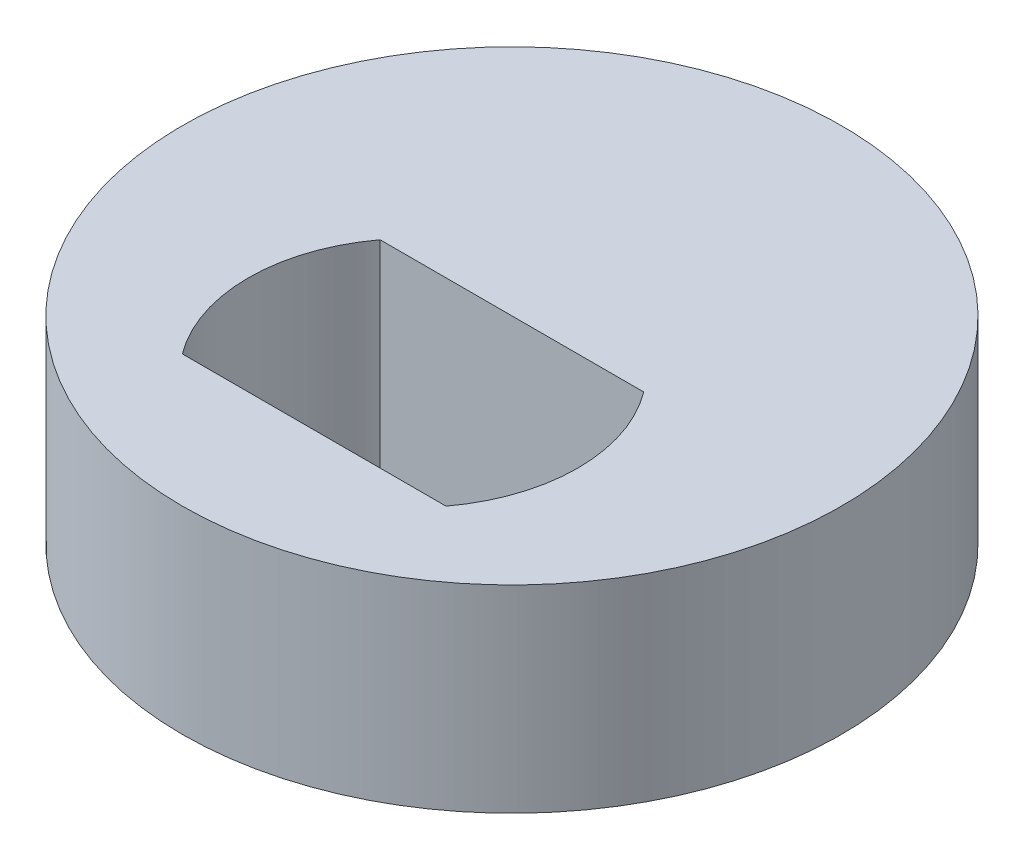
ISO-10303-21;
HEADER;
FILE_DESCRIPTION(('STEP AP214'),'2;1');
FILE_NAME('part.step','',(''),(''),'','','');
FILE_SCHEMA(('AUTOMOTIVE_DESIGN { 1 0 10303 214 1 1 1 1 }'));
ENDSEC;
DATA;
#1=APPLICATION_CONTEXT('core data for automotive mechanical design processes');
#2=APPLICATION_PROTOCOL_DEFINITION('international standard','automotive_design',2000,#1);
#3=PRODUCT_CONTEXT('',#1,'mechanical');
#4=PRODUCT('Part','Part','',(#3));
#5=PRODUCT_RELATED_PRODUCT_CATEGORY('part','',(#4));
#6=PRODUCT_DEFINITION_FORMATION('','',#4);
#7=PRODUCT_DEFINITION_CONTEXT('part definition',#1,'design');
#8=PRODUCT_DEFINITION('design','',#6,#7);
#9=PRODUCT_DEFINITION_SHAPE('','',#8);
#10=(LENGTH_UNIT() NAMED_UNIT(*) SI_UNIT(.MILLI.,.METRE.));
#11=(NAMED_UNIT(*) PLANE_ANGLE_UNIT() SI_UNIT($,.RADIAN.));
#12=(NAMED_UNIT(*) SI_UNIT($,.STERADIAN.) SOLID_ANGLE_UNIT());
#13=UNCERTAINTY_MEASURE_WITH_UNIT(LENGTH_MEASURE(1.E-05),#10,'distance_accuracy_value','');
#14=(GEOMETRIC_REPRESENTATION_CONTEXT(3) GLOBAL_UNCERTAINTY_ASSIGNED_CONTEXT((#13)) GLOBAL_UNIT_ASSIGNED_CONTEXT((#10,
#11,#12)) REPRESENTATION_CONTEXT('',''));
#15=CARTESIAN_POINT('',(0.,0.,0.));
#16=DIRECTION('',(0.,0.,1.));
#17=DIRECTION('',(1.,0.,0.));
#18=AXIS2_PLACEMENT_3D('',#15,#16,#17);
#19=CARTESIAN_POINT('',(0.,3.,0.));
#20=DIRECTION('',(0.,1.,0.));
#21=DIRECTION('',(0.,0.,1.));
#22=AXIS2_PLACEMENT_3D('',#19,#20,#21);
#23=PLANE('',#22);
#24=CARTESIAN_POINT('',(0.,3.,0.));
#25=DIRECTION('',(0.,1.,0.));
#26=DIRECTION('',(0.,0.,1.));
#27=AXIS2_PLACEMENT_3D('',#24,#25,#26);
#28=CIRCLE('',#27,5.);
#29=CARTESIAN_POINT('',(0.,3.,5.));
#30=VERTEX_POINT('',#29);
#31=EDGE_CURVE('E11',#30,#30,#28,.T.);
#32=ORIENTED_EDGE('',*,*,#31,.T.);
#33=EDGE_LOOP('',(#32));
#34=FACE_BOUND('',#33,.T.);
#35=DIRECTION('',(1.,0.,0.));
#36=VECTOR('',#35,1.);
#37=CARTESIAN_POINT('',(-2.,3.,3.));
#38=LINE('',#37,#36);
#39=CARTESIAN_POINT('',(-2.,3.,3.));
#40=VERTEX_POINT('',#39);
#41=CARTESIAN_POINT('',(2.,3.,3.));
#42=VERTEX_POINT('',#41);
#43=EDGE_CURVE('E95',#40,#42,#38,.T.);
#44=ORIENTED_EDGE('',*,*,#43,.F.);
#45=CARTESIAN_POINT('',(0.,3.,1.5));
#46=DIRECTION('',(0.,1.,0.));
#47=DIRECTION('',(0.,0.,1.));
#48=AXIS2_PLACEMENT_3D('',#45,#46,#47);
#49=CIRCLE('',#48,2.5);
#50=CARTESIAN_POINT('',(-2.,3.,0.));
#51=VERTEX_POINT('',#50);
#52=EDGE_CURVE('E86',#51,#40,#49,.T.);
#53=ORIENTED_EDGE('',*,*,#52,.F.);
#54=DIRECTION('',(-1.,0.,0.));
#55=VECTOR('',#54,1.);
#56=CARTESIAN_POINT('',(-2.,3.,0.));
#57=LINE('',#56,#55);
#58=CARTESIAN_POINT('',(2.,3.,0.));
#59=VERTEX_POINT('',#58);
#60=EDGE_CURVE('E111',#59,#51,#57,.T.);
#61=ORIENTED_EDGE('',*,*,#60,.F.);
#62=CARTESIAN_POINT('',(0.,3.,1.5));
#63=DIRECTION('',(0.,1.,0.));
#64=DIRECTION('',(0.,0.,1.));
#65=AXIS2_PLACEMENT_3D('',#62,#63,#64);
#66=CIRCLE('',#65,2.5);
#67=EDGE_CURVE('E107',#42,#59,#66,.T.);
#68=ORIENTED_EDGE('',*,*,#67,.F.);
#69=EDGE_LOOP('',(#44,#53,#61,#68));
#70=FACE_BOUND('',#69,.T.);
#71=ADVANCED_FACE('F44',(#34,#70),#23,.T.);
#72=CARTESIAN_POINT('',(0.,0.,0.));
#73=DIRECTION('',(0.,1.,0.));
#74=DIRECTION('',(0.,0.,1.));
#75=AXIS2_PLACEMENT_3D('',#72,#73,#74);
#76=PLANE('',#75);
#77=CARTESIAN_POINT('',(0.,0.,0.));
#78=DIRECTION('',(0.,1.,0.));
#79=DIRECTION('',(0.,0.,1.));
#80=AXIS2_PLACEMENT_3D('',#77,#78,#79);
#81=CIRCLE('',#80,5.);
#82=CARTESIAN_POINT('',(0.,0.,5.));
#83=VERTEX_POINT('',#82);
#84=EDGE_CURVE('E48',#83,#83,#81,.T.);
#85=ORIENTED_EDGE('',*,*,#84,.F.);
#86=EDGE_LOOP('',(#85));
#87=FACE_BOUND('',#86,.T.);
#88=CARTESIAN_POINT('',(0.,0.,1.5));
#89=DIRECTION('',(0.,1.,0.));
#90=DIRECTION('',(0.,0.,1.));
#91=AXIS2_PLACEMENT_3D('',#88,#89,#90);
#92=CIRCLE('',#91,2.5);
#93=CARTESIAN_POINT('',(-2.,0.,0.));
#94=VERTEX_POINT('',#93);
#95=CARTESIAN_POINT('',(-2.,0.,3.));
#96=VERTEX_POINT('',#95);
#97=EDGE_CURVE('E68',#94,#96,#92,.T.);
#98=ORIENTED_EDGE('',*,*,#97,.T.);
#99=DIRECTION('',(1.,0.,0.));
#100=VECTOR('',#99,1.);
#101=CARTESIAN_POINT('',(-2.,0.,3.));
#102=LINE('',#101,#100);
#103=CARTESIAN_POINT('',(2.,0.,3.));
#104=VERTEX_POINT('',#103);
#105=EDGE_CURVE('E102',#96,#104,#102,.T.);
#106=ORIENTED_EDGE('',*,*,#105,.T.);
#107=CARTESIAN_POINT('',(0.,0.,1.5));
#108=DIRECTION('',(0.,1.,0.));
#109=DIRECTION('',(0.,0.,1.));
#110=AXIS2_PLACEMENT_3D('',#107,#108,#109);
#111=CIRCLE('',#110,2.5);
#112=CARTESIAN_POINT('',(2.,0.,0.));
#113=VERTEX_POINT('',#112);
#114=EDGE_CURVE('E120',#104,#113,#111,.T.);
#115=ORIENTED_EDGE('',*,*,#114,.T.);
#116=DIRECTION('',(-1.,0.,0.));
#117=VECTOR('',#116,1.);
#118=CARTESIAN_POINT('',(-2.,0.,0.));
#119=LINE('',#118,#117);
#120=EDGE_CURVE('E96',#113,#94,#119,.T.);
#121=ORIENTED_EDGE('',*,*,#120,.T.);
#122=EDGE_LOOP('',(#98,#106,#115,#121));
#123=FACE_BOUND('',#122,.T.);
#124=ADVANCED_FACE('F136',(#87,#123),#76,.F.);
#125=CARTESIAN_POINT('',(0.,3.,0.));
#126=DIRECTION('',(0.,-1.,0.));
#127=DIRECTION('',(0.,0.,-1.));
#128=AXIS2_PLACEMENT_3D('',#125,#126,#127);
#129=CYLINDRICAL_SURFACE('',#128,5.);
#130=ORIENTED_EDGE('',*,*,#31,.F.);
#131=EDGE_LOOP('',(#130));
#132=FACE_BOUND('',#131,.T.);
#133=ORIENTED_EDGE('',*,*,#84,.T.);
#134=EDGE_LOOP('',(#133));
#135=FACE_BOUND('',#134,.T.);
#136=ADVANCED_FACE('F46',(#132,#135),#129,.T.);
#137=CARTESIAN_POINT('',(0.,3.,1.5));
#138=DIRECTION('',(0.,-1.,0.));
#139=DIRECTION('',(0.,0.,-1.));
#140=AXIS2_PLACEMENT_3D('',#137,#138,#139);
#141=CYLINDRICAL_SURFACE('',#140,2.5);
#142=ORIENTED_EDGE('',*,*,#97,.F.);
#143=DIRECTION('',(0.,-1.,0.));
#144=VECTOR('',#143,1.);
#145=CARTESIAN_POINT('',(-2.,3.,0.));
#146=LINE('',#145,#144);
#147=EDGE_CURVE('E90',#51,#94,#146,.T.);
#148=ORIENTED_EDGE('',*,*,#147,.F.);
#149=ORIENTED_EDGE('',*,*,#52,.T.);
#150=DIRECTION('',(0.,-1.,0.));
#151=VECTOR('',#150,1.);
#152=CARTESIAN_POINT('',(-2.,3.,3.));
#153=LINE('',#152,#151);
#154=EDGE_CURVE('E89',#40,#96,#153,.T.);
#155=ORIENTED_EDGE('',*,*,#154,.T.);
#156=EDGE_LOOP('',(#142,#148,#149,#155));
#157=FACE_BOUND('',#156,.T.);
#158=ADVANCED_FACE('F88',(#157),#141,.F.);
#159=CARTESIAN_POINT('',(-2.,3.,3.));
#160=DIRECTION('',(0.,0.,-1.));
#161=DIRECTION('',(-1.,0.,0.));
#162=AXIS2_PLACEMENT_3D('',#159,#160,#161);
#163=PLANE('',#162);
#164=ORIENTED_EDGE('',*,*,#105,.F.);
#165=ORIENTED_EDGE('',*,*,#154,.F.);
#166=ORIENTED_EDGE('',*,*,#43,.T.);
#167=DIRECTION('',(0.,-1.,0.));
#168=VECTOR('',#167,1.);
#169=CARTESIAN_POINT('',(2.,3.,3.));
#170=LINE('',#169,#168);
#171=EDGE_CURVE('E104',#42,#104,#170,.T.);
#172=ORIENTED_EDGE('',*,*,#171,.T.);
#173=EDGE_LOOP('',(#164,#165,#166,#172));
#174=FACE_BOUND('',#173,.T.);
#175=ADVANCED_FACE('F99',(#174),#163,.T.);
#176=CARTESIAN_POINT('',(0.,3.,1.5));
#177=DIRECTION('',(0.,-1.,0.));
#178=DIRECTION('',(0.,0.,-1.));
#179=AXIS2_PLACEMENT_3D('',#176,#177,#178);
#180=CYLINDRICAL_SURFACE('',#179,2.5);
#181=ORIENTED_EDGE('',*,*,#114,.F.);
#182=ORIENTED_EDGE('',*,*,#171,.F.);
#183=ORIENTED_EDGE('',*,*,#67,.T.);
#184=DIRECTION('',(0.,-1.,0.));
#185=VECTOR('',#184,1.);
#186=CARTESIAN_POINT('',(2.,3.,0.));
#187=LINE('',#186,#185);
#188=EDGE_CURVE('E60',#59,#113,#187,.T.);
#189=ORIENTED_EDGE('',*,*,#188,.T.);
#190=EDGE_LOOP('',(#181,#182,#183,#189));
#191=FACE_BOUND('',#190,.T.);
#192=ADVANCED_FACE('F134',(#191),#180,.F.);
#193=CARTESIAN_POINT('',(-2.,3.,0.));
#194=DIRECTION('',(0.,0.,1.));
#195=DIRECTION('',(1.,0.,0.));
#196=AXIS2_PLACEMENT_3D('',#193,#194,#195);
#197=PLANE('',#196);
#198=ORIENTED_EDGE('',*,*,#120,.F.);
#199=ORIENTED_EDGE('',*,*,#188,.F.);
#200=ORIENTED_EDGE('',*,*,#60,.T.);
#201=ORIENTED_EDGE('',*,*,#147,.T.);
#202=EDGE_LOOP('',(#198,#199,#200,#201));
#203=FACE_BOUND('',#202,.T.);
#204=ADVANCED_FACE('F137',(#203),#197,.T.);
#205=CLOSED_SHELL('',(#71,#124,#136,#158,#175,#192,#204));
#206=MANIFOLD_SOLID_BREP('B2',#205);
#207=ADVANCED_BREP_SHAPE_REPRESENTATION('',(#18,#206),#14);
#208=SHAPE_DEFINITION_REPRESENTATION(#9,#207);
ENDSEC;
END-ISO-10303-21;
